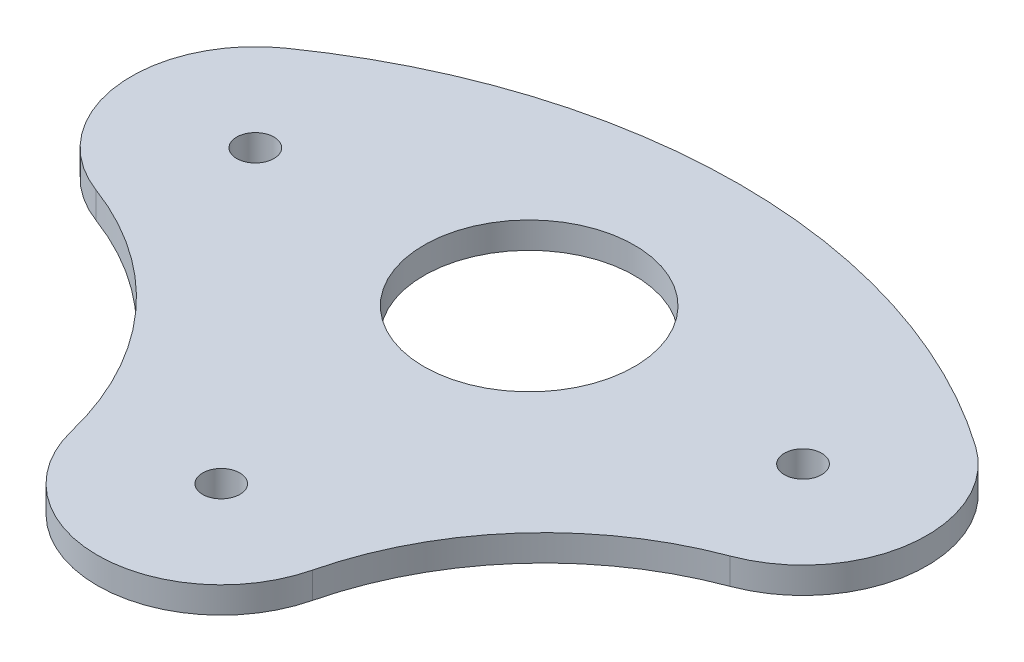
ISO-10303-21;
HEADER;
FILE_DESCRIPTION(('STEP AP214'),'2;1');
FILE_NAME('part.step','',(''),(''),'','','');
FILE_SCHEMA(('AUTOMOTIVE_DESIGN { 1 0 10303 214 1 1 1 1 }'));
ENDSEC;
DATA;
#1=APPLICATION_CONTEXT('core data for automotive mechanical design processes');
#2=APPLICATION_PROTOCOL_DEFINITION('international standard','automotive_design',2000,#1);
#3=PRODUCT_CONTEXT('',#1,'mechanical');
#4=PRODUCT('Part','Part','',(#3));
#5=PRODUCT_RELATED_PRODUCT_CATEGORY('part','',(#4));
#6=PRODUCT_DEFINITION_FORMATION('','',#4);
#7=PRODUCT_DEFINITION_CONTEXT('part definition',#1,'design');
#8=PRODUCT_DEFINITION('design','',#6,#7);
#9=PRODUCT_DEFINITION_SHAPE('','',#8);
#10=(LENGTH_UNIT() NAMED_UNIT(*) SI_UNIT(.MILLI.,.METRE.));
#11=(NAMED_UNIT(*) PLANE_ANGLE_UNIT() SI_UNIT($,.RADIAN.));
#12=(NAMED_UNIT(*) SI_UNIT($,.STERADIAN.) SOLID_ANGLE_UNIT());
#13=UNCERTAINTY_MEASURE_WITH_UNIT(LENGTH_MEASURE(1.E-05),#10,'distance_accuracy_value','');
#14=(GEOMETRIC_REPRESENTATION_CONTEXT(3) GLOBAL_UNCERTAINTY_ASSIGNED_CONTEXT((#13)) GLOBAL_UNIT_ASSIGNED_CONTEXT((#10,
#11,#12)) REPRESENTATION_CONTEXT('',''));
#15=CARTESIAN_POINT('',(0.,0.,0.));
#16=DIRECTION('',(0.,0.,1.));
#17=DIRECTION('',(1.,0.,0.));
#18=AXIS2_PLACEMENT_3D('',#15,#16,#17);
#19=CARTESIAN_POINT('',(16.5174,3.175,23.4951079196172));
#20=DIRECTION('',(0.,-1.,0.));
#21=DIRECTION('',(0.,0.,-1.));
#22=AXIS2_PLACEMENT_3D('',#19,#20,#21);
#23=PLANE('',#22);
#24=CARTESIAN_POINT('',(0.,3.175,46.9902158392344));
#25=DIRECTION('',(0.,1.,0.));
#26=DIRECTION('',(0.,0.,-1.));
#27=AXIS2_PLACEMENT_3D('',#24,#25,#26);
#28=CIRCLE('',#27,72.3902158392344);
#29=CARTESIAN_POINT('',(41.6327875385959,3.175,-12.2301721282306));
#30=VERTEX_POINT('',#29);
#31=CARTESIAN_POINT('',(-41.6327875385959,3.175,-12.2301721282306));
#32=VERTEX_POINT('',#31);
#33=EDGE_CURVE('E129',#30,#32,#28,.T.);
#34=ORIENTED_EDGE('',*,*,#33,.T.);
#35=CARTESIAN_POINT('',(-33.0348,3.175,0.));
#36=DIRECTION('',(0.,1.,0.));
#37=DIRECTION('',(0.,0.,1.));
#38=AXIS2_PLACEMENT_3D('',#35,#36,#37);
#39=CIRCLE('',#38,14.95);
#40=CARTESIAN_POINT('',(-38.2495467618594,3.175,14.0110283780198));
#41=VERTEX_POINT('',#40);
#42=EDGE_CURVE('E87',#32,#41,#39,.T.);
#43=ORIENTED_EDGE('',*,*,#42,.T.);
#44=CARTESIAN_POINT('',(-51.5393027235213,3.175,49.7180639099633));
#45=DIRECTION('',(0.,-1.,0.));
#46=DIRECTION('',(0.,0.,-1.));
#47=AXIS2_PLACEMENT_3D('',#44,#45,#46);
#48=CIRCLE('',#47,38.1);
#49=CARTESIAN_POINT('',(-14.5242709842911,3.175,40.690471465475));
#50=VERTEX_POINT('',#49);
#51=EDGE_CURVE('E100',#41,#50,#48,.T.);
#52=ORIENTED_EDGE('',*,*,#51,.T.);
#53=CARTESIAN_POINT('',(0.,3.175,37.1481484459185));
#54=DIRECTION('',(0.,1.,0.));
#55=DIRECTION('',(0.,0.,1.));
#56=AXIS2_PLACEMENT_3D('',#53,#54,#55);
#57=CIRCLE('',#56,14.95);
#58=CARTESIAN_POINT('',(14.5242709842911,3.175,40.690471465475));
#59=VERTEX_POINT('',#58);
#60=EDGE_CURVE('E94',#50,#59,#57,.T.);
#61=ORIENTED_EDGE('',*,*,#60,.T.);
#62=CARTESIAN_POINT('',(51.5393027235213,3.175,49.7180639099633));
#63=DIRECTION('',(0.,-1.,0.));
#64=DIRECTION('',(0.,0.,-1.));
#65=AXIS2_PLACEMENT_3D('',#62,#63,#64);
#66=CIRCLE('',#65,38.1);
#67=CARTESIAN_POINT('',(38.2495467618594,3.175,14.0110283780198));
#68=VERTEX_POINT('',#67);
#69=EDGE_CURVE('E98',#59,#68,#66,.T.);
#70=ORIENTED_EDGE('',*,*,#69,.T.);
#71=CARTESIAN_POINT('',(33.0348,3.175,0.));
#72=DIRECTION('',(0.,1.,0.));
#73=DIRECTION('',(0.,0.,1.));
#74=AXIS2_PLACEMENT_3D('',#71,#72,#73);
#75=CIRCLE('',#74,14.95);
#76=EDGE_CURVE('E50',#68,#30,#75,.T.);
#77=ORIENTED_EDGE('',*,*,#76,.T.);
#78=EDGE_LOOP('',(#34,#43,#52,#61,#70,#77));
#79=FACE_BOUND('',#78,.T.);
#80=CARTESIAN_POINT('',(0.,3.175,0.));
#81=DIRECTION('',(0.,1.,0.));
#82=DIRECTION('',(0.,0.,1.));
#83=AXIS2_PLACEMENT_3D('',#80,#81,#82);
#84=CIRCLE('',#83,12.7);
#85=CARTESIAN_POINT('',(0.,3.175,12.7));
#86=VERTEX_POINT('',#85);
#87=EDGE_CURVE('E122',#86,#86,#84,.T.);
#88=ORIENTED_EDGE('',*,*,#87,.F.);
#89=EDGE_LOOP('',(#88));
#90=FACE_BOUND('',#89,.T.);
#91=CARTESIAN_POINT('',(-33.0348,3.175,0.));
#92=DIRECTION('',(0.,1.,0.));
#93=DIRECTION('',(0.,0.,1.));
#94=AXIS2_PLACEMENT_3D('',#91,#92,#93);
#95=CIRCLE('',#94,2.25000000000001);
#96=CARTESIAN_POINT('',(-33.0348,3.175,2.25000000000002));
#97=VERTEX_POINT('',#96);
#98=EDGE_CURVE('E193',#97,#97,#95,.T.);
#99=ORIENTED_EDGE('',*,*,#98,.F.);
#100=EDGE_LOOP('',(#99));
#101=FACE_BOUND('',#100,.T.);
#102=CARTESIAN_POINT('',(33.0348,3.175,0.));
#103=DIRECTION('',(0.,1.,0.));
#104=DIRECTION('',(0.,0.,1.));
#105=AXIS2_PLACEMENT_3D('',#102,#103,#104);
#106=CIRCLE('',#105,2.25000000000001);
#107=CARTESIAN_POINT('',(33.0348,3.175,2.25000000000001));
#108=VERTEX_POINT('',#107);
#109=EDGE_CURVE('E187',#108,#108,#106,.T.);
#110=ORIENTED_EDGE('',*,*,#109,.F.);
#111=EDGE_LOOP('',(#110));
#112=FACE_BOUND('',#111,.T.);
#113=CARTESIAN_POINT('',(0.,3.175,37.1481484459185));
#114=DIRECTION('',(0.,1.,0.));
#115=DIRECTION('',(0.,0.,1.));
#116=AXIS2_PLACEMENT_3D('',#113,#114,#115);
#117=CIRCLE('',#116,2.24999999999998);
#118=CARTESIAN_POINT('',(0.,3.175,39.3981484459185));
#119=VERTEX_POINT('',#118);
#120=EDGE_CURVE('E178',#119,#119,#117,.T.);
#121=ORIENTED_EDGE('',*,*,#120,.F.);
#122=EDGE_LOOP('',(#121));
#123=FACE_BOUND('',#122,.T.);
#124=ADVANCED_FACE('F33',(#79,#90,#101,#112,#123),#23,.F.);
#125=CARTESIAN_POINT('',(16.5174,0.,23.4951079196172));
#126=DIRECTION('',(0.,-1.,0.));
#127=DIRECTION('',(0.,0.,-1.));
#128=AXIS2_PLACEMENT_3D('',#125,#126,#127);
#129=PLANE('',#128);
#130=CARTESIAN_POINT('',(33.0348,0.,0.));
#131=DIRECTION('',(0.,1.,0.));
#132=DIRECTION('',(0.,0.,1.));
#133=AXIS2_PLACEMENT_3D('',#130,#131,#132);
#134=CIRCLE('',#133,2.25000000000001);
#135=CARTESIAN_POINT('',(33.0348,0.,2.25000000000001));
#136=VERTEX_POINT('',#135);
#137=EDGE_CURVE('E184',#136,#136,#134,.T.);
#138=ORIENTED_EDGE('',*,*,#137,.T.);
#139=EDGE_LOOP('',(#138));
#140=FACE_BOUND('',#139,.T.);
#141=CARTESIAN_POINT('',(0.,0.,0.));
#142=DIRECTION('',(0.,1.,0.));
#143=DIRECTION('',(0.,0.,1.));
#144=AXIS2_PLACEMENT_3D('',#141,#142,#143);
#145=CIRCLE('',#144,12.7);
#146=CARTESIAN_POINT('',(0.,0.,12.7));
#147=VERTEX_POINT('',#146);
#148=EDGE_CURVE('E196',#147,#147,#145,.T.);
#149=ORIENTED_EDGE('',*,*,#148,.T.);
#150=EDGE_LOOP('',(#149));
#151=FACE_BOUND('',#150,.T.);
#152=CARTESIAN_POINT('',(0.,0.,46.9902158392344));
#153=DIRECTION('',(0.,1.,0.));
#154=DIRECTION('',(0.,0.,-1.));
#155=AXIS2_PLACEMENT_3D('',#152,#153,#154);
#156=CIRCLE('',#155,72.3902158392344);
#157=CARTESIAN_POINT('',(41.6327875385959,0.,-12.2301721282306));
#158=VERTEX_POINT('',#157);
#159=CARTESIAN_POINT('',(-41.6327875385959,0.,-12.2301721282306));
#160=VERTEX_POINT('',#159);
#161=EDGE_CURVE('E118',#158,#160,#156,.T.);
#162=ORIENTED_EDGE('',*,*,#161,.F.);
#163=CARTESIAN_POINT('',(33.0348,0.,0.));
#164=DIRECTION('',(0.,1.,0.));
#165=DIRECTION('',(0.,0.,1.));
#166=AXIS2_PLACEMENT_3D('',#163,#164,#165);
#167=CIRCLE('',#166,14.95);
#168=CARTESIAN_POINT('',(38.2495467618594,0.,14.0110283780198));
#169=VERTEX_POINT('',#168);
#170=EDGE_CURVE('E79',#169,#158,#167,.T.);
#171=ORIENTED_EDGE('',*,*,#170,.F.);
#172=CARTESIAN_POINT('',(51.5393027235213,0.,49.7180639099633));
#173=DIRECTION('',(0.,-1.,0.));
#174=DIRECTION('',(0.,0.,-1.));
#175=AXIS2_PLACEMENT_3D('',#172,#173,#174);
#176=CIRCLE('',#175,38.1);
#177=CARTESIAN_POINT('',(14.5242709842911,0.,40.690471465475));
#178=VERTEX_POINT('',#177);
#179=EDGE_CURVE('E73',#178,#169,#176,.T.);
#180=ORIENTED_EDGE('',*,*,#179,.F.);
#181=CARTESIAN_POINT('',(0.,0.,37.1481484459185));
#182=DIRECTION('',(0.,1.,0.));
#183=DIRECTION('',(0.,0.,1.));
#184=AXIS2_PLACEMENT_3D('',#181,#182,#183);
#185=CIRCLE('',#184,14.95);
#186=CARTESIAN_POINT('',(-14.5242709842911,0.,40.690471465475));
#187=VERTEX_POINT('',#186);
#188=EDGE_CURVE('E108',#187,#178,#185,.T.);
#189=ORIENTED_EDGE('',*,*,#188,.F.);
#190=CARTESIAN_POINT('',(-51.5393027235213,0.,49.7180639099633));
#191=DIRECTION('',(0.,-1.,0.));
#192=DIRECTION('',(0.,0.,-1.));
#193=AXIS2_PLACEMENT_3D('',#190,#191,#192);
#194=CIRCLE('',#193,38.1);
#195=CARTESIAN_POINT('',(-38.2495467618594,0.,14.0110283780198));
#196=VERTEX_POINT('',#195);
#197=EDGE_CURVE('E124',#196,#187,#194,.T.);
#198=ORIENTED_EDGE('',*,*,#197,.F.);
#199=CARTESIAN_POINT('',(-33.0348,0.,0.));
#200=DIRECTION('',(0.,1.,0.));
#201=DIRECTION('',(0.,0.,1.));
#202=AXIS2_PLACEMENT_3D('',#199,#200,#201);
#203=CIRCLE('',#202,14.95);
#204=EDGE_CURVE('E121',#160,#196,#203,.T.);
#205=ORIENTED_EDGE('',*,*,#204,.F.);
#206=EDGE_LOOP('',(#162,#171,#180,#189,#198,#205));
#207=FACE_BOUND('',#206,.T.);
#208=CARTESIAN_POINT('',(-33.0348,0.,0.));
#209=DIRECTION('',(0.,1.,0.));
#210=DIRECTION('',(0.,0.,1.));
#211=AXIS2_PLACEMENT_3D('',#208,#209,#210);
#212=CIRCLE('',#211,2.25000000000001);
#213=CARTESIAN_POINT('',(-33.0348,0.,2.25000000000002));
#214=VERTEX_POINT('',#213);
#215=EDGE_CURVE('E190',#214,#214,#212,.T.);
#216=ORIENTED_EDGE('',*,*,#215,.T.);
#217=EDGE_LOOP('',(#216));
#218=FACE_BOUND('',#217,.T.);
#219=CARTESIAN_POINT('',(0.,0.,37.1481484459185));
#220=DIRECTION('',(0.,1.,0.));
#221=DIRECTION('',(0.,0.,1.));
#222=AXIS2_PLACEMENT_3D('',#219,#220,#221);
#223=CIRCLE('',#222,2.24999999999998);
#224=CARTESIAN_POINT('',(0.,0.,39.3981484459185));
#225=VERTEX_POINT('',#224);
#226=EDGE_CURVE('E181',#225,#225,#223,.T.);
#227=ORIENTED_EDGE('',*,*,#226,.T.);
#228=EDGE_LOOP('',(#227));
#229=FACE_BOUND('',#228,.T.);
#230=ADVANCED_FACE('F138',(#140,#151,#207,#218,#229),#129,.T.);
#231=CARTESIAN_POINT('',(0.,3.175,46.9902158392344));
#232=DIRECTION('',(0.,-1.,0.));
#233=DIRECTION('',(0.,0.,-1.));
#234=AXIS2_PLACEMENT_3D('',#231,#232,#233);
#235=CYLINDRICAL_SURFACE('',#234,72.3902158392344);
#236=ORIENTED_EDGE('',*,*,#161,.T.);
#237=DIRECTION('',(0.,-1.,0.));
#238=VECTOR('',#237,1.);
#239=CARTESIAN_POINT('',(-41.6327875385959,3.175,-12.2301721282306));
#240=LINE('',#239,#238);
#241=EDGE_CURVE('E11',#32,#160,#240,.T.);
#242=ORIENTED_EDGE('',*,*,#241,.F.);
#243=ORIENTED_EDGE('',*,*,#33,.F.);
#244=DIRECTION('',(0.,-1.,0.));
#245=VECTOR('',#244,1.);
#246=CARTESIAN_POINT('',(41.6327875385959,3.175,-12.2301721282306));
#247=LINE('',#246,#245);
#248=EDGE_CURVE('E114',#30,#158,#247,.T.);
#249=ORIENTED_EDGE('',*,*,#248,.T.);
#250=EDGE_LOOP('',(#236,#242,#243,#249));
#251=FACE_BOUND('',#250,.T.);
#252=ADVANCED_FACE('F35',(#251),#235,.T.);
#253=CARTESIAN_POINT('',(-33.0348,3.175,0.));
#254=DIRECTION('',(0.,-1.,0.));
#255=DIRECTION('',(0.,0.,-1.));
#256=AXIS2_PLACEMENT_3D('',#253,#254,#255);
#257=CYLINDRICAL_SURFACE('',#256,14.95);
#258=ORIENTED_EDGE('',*,*,#204,.T.);
#259=DIRECTION('',(0.,-1.,0.));
#260=VECTOR('',#259,1.);
#261=CARTESIAN_POINT('',(-38.2495467618594,3.175,14.0110283780198));
#262=LINE('',#261,#260);
#263=EDGE_CURVE('E42',#41,#196,#262,.T.);
#264=ORIENTED_EDGE('',*,*,#263,.F.);
#265=ORIENTED_EDGE('',*,*,#42,.F.);
#266=ORIENTED_EDGE('',*,*,#241,.T.);
#267=EDGE_LOOP('',(#258,#264,#265,#266));
#268=FACE_BOUND('',#267,.T.);
#269=ADVANCED_FACE('F256',(#268),#257,.T.);
#270=CARTESIAN_POINT('',(-51.5393027235213,3.175,49.7180639099633));
#271=DIRECTION('',(0.,-1.,0.));
#272=DIRECTION('',(0.,0.,-1.));
#273=AXIS2_PLACEMENT_3D('',#270,#271,#272);
#274=CYLINDRICAL_SURFACE('',#273,38.1);
#275=ORIENTED_EDGE('',*,*,#197,.T.);
#276=DIRECTION('',(0.,-1.,0.));
#277=VECTOR('',#276,1.);
#278=CARTESIAN_POINT('',(-14.5242709842911,3.175,40.690471465475));
#279=LINE('',#278,#277);
#280=EDGE_CURVE('E109',#50,#187,#279,.T.);
#281=ORIENTED_EDGE('',*,*,#280,.F.);
#282=ORIENTED_EDGE('',*,*,#51,.F.);
#283=ORIENTED_EDGE('',*,*,#263,.T.);
#284=EDGE_LOOP('',(#275,#281,#282,#283));
#285=FACE_BOUND('',#284,.T.);
#286=ADVANCED_FACE('F135',(#285),#274,.F.);
#287=CARTESIAN_POINT('',(0.,3.175,37.1481484459185));
#288=DIRECTION('',(0.,-1.,0.));
#289=DIRECTION('',(0.,0.,-1.));
#290=AXIS2_PLACEMENT_3D('',#287,#288,#289);
#291=CYLINDRICAL_SURFACE('',#290,14.95);
#292=ORIENTED_EDGE('',*,*,#188,.T.);
#293=DIRECTION('',(0.,-1.,0.));
#294=VECTOR('',#293,1.);
#295=CARTESIAN_POINT('',(14.5242709842911,3.175,40.690471465475));
#296=LINE('',#295,#294);
#297=EDGE_CURVE('E105',#59,#178,#296,.T.);
#298=ORIENTED_EDGE('',*,*,#297,.F.);
#299=ORIENTED_EDGE('',*,*,#60,.F.);
#300=ORIENTED_EDGE('',*,*,#280,.T.);
#301=EDGE_LOOP('',(#292,#298,#299,#300));
#302=FACE_BOUND('',#301,.T.);
#303=ADVANCED_FACE('F106',(#302),#291,.T.);
#304=CARTESIAN_POINT('',(51.5393027235213,3.175,49.7180639099633));
#305=DIRECTION('',(0.,-1.,0.));
#306=DIRECTION('',(0.,0.,-1.));
#307=AXIS2_PLACEMENT_3D('',#304,#305,#306);
#308=CYLINDRICAL_SURFACE('',#307,38.1);
#309=ORIENTED_EDGE('',*,*,#179,.T.);
#310=DIRECTION('',(0.,-1.,0.));
#311=VECTOR('',#310,1.);
#312=CARTESIAN_POINT('',(38.2495467618594,3.175,14.0110283780198));
#313=LINE('',#312,#311);
#314=EDGE_CURVE('E110',#68,#169,#313,.T.);
#315=ORIENTED_EDGE('',*,*,#314,.F.);
#316=ORIENTED_EDGE('',*,*,#69,.F.);
#317=ORIENTED_EDGE('',*,*,#297,.T.);
#318=EDGE_LOOP('',(#309,#315,#316,#317));
#319=FACE_BOUND('',#318,.T.);
#320=ADVANCED_FACE('F112',(#319),#308,.F.);
#321=CARTESIAN_POINT('',(33.0348,3.175,0.));
#322=DIRECTION('',(0.,-1.,0.));
#323=DIRECTION('',(0.,0.,-1.));
#324=AXIS2_PLACEMENT_3D('',#321,#322,#323);
#325=CYLINDRICAL_SURFACE('',#324,14.95);
#326=ORIENTED_EDGE('',*,*,#170,.T.);
#327=ORIENTED_EDGE('',*,*,#248,.F.);
#328=ORIENTED_EDGE('',*,*,#76,.F.);
#329=ORIENTED_EDGE('',*,*,#314,.T.);
#330=EDGE_LOOP('',(#326,#327,#328,#329));
#331=FACE_BOUND('',#330,.T.);
#332=ADVANCED_FACE('F143',(#331),#325,.T.);
#333=CARTESIAN_POINT('',(0.,3.175,0.));
#334=DIRECTION('',(0.,-1.,0.));
#335=DIRECTION('',(0.,0.,-1.));
#336=AXIS2_PLACEMENT_3D('',#333,#334,#335);
#337=CYLINDRICAL_SURFACE('',#336,12.7);
#338=ORIENTED_EDGE('',*,*,#87,.T.);
#339=EDGE_LOOP('',(#338));
#340=FACE_BOUND('',#339,.T.);
#341=ORIENTED_EDGE('',*,*,#148,.F.);
#342=EDGE_LOOP('',(#341));
#343=FACE_BOUND('',#342,.T.);
#344=ADVANCED_FACE('F145',(#340,#343),#337,.F.);
#345=CARTESIAN_POINT('',(-33.0348,3.175,0.));
#346=DIRECTION('',(0.,-1.,0.));
#347=DIRECTION('',(0.,0.,-1.));
#348=AXIS2_PLACEMENT_3D('',#345,#346,#347);
#349=CYLINDRICAL_SURFACE('',#348,2.25000000000001);
#350=ORIENTED_EDGE('',*,*,#98,.T.);
#351=EDGE_LOOP('',(#350));
#352=FACE_BOUND('',#351,.T.);
#353=ORIENTED_EDGE('',*,*,#215,.F.);
#354=EDGE_LOOP('',(#353));
#355=FACE_BOUND('',#354,.T.);
#356=ADVANCED_FACE('F151',(#352,#355),#349,.F.);
#357=CARTESIAN_POINT('',(33.0348,3.175,0.));
#358=DIRECTION('',(0.,-1.,0.));
#359=DIRECTION('',(0.,0.,-1.));
#360=AXIS2_PLACEMENT_3D('',#357,#358,#359);
#361=CYLINDRICAL_SURFACE('',#360,2.25000000000001);
#362=ORIENTED_EDGE('',*,*,#109,.T.);
#363=EDGE_LOOP('',(#362));
#364=FACE_BOUND('',#363,.T.);
#365=ORIENTED_EDGE('',*,*,#137,.F.);
#366=EDGE_LOOP('',(#365));
#367=FACE_BOUND('',#366,.T.);
#368=ADVANCED_FACE('F165',(#364,#367),#361,.F.);
#369=CARTESIAN_POINT('',(0.,3.175,37.1481484459185));
#370=DIRECTION('',(0.,-1.,0.));
#371=DIRECTION('',(0.,0.,-1.));
#372=AXIS2_PLACEMENT_3D('',#369,#370,#371);
#373=CYLINDRICAL_SURFACE('',#372,2.24999999999998);
#374=ORIENTED_EDGE('',*,*,#120,.T.);
#375=EDGE_LOOP('',(#374));
#376=FACE_BOUND('',#375,.T.);
#377=ORIENTED_EDGE('',*,*,#226,.F.);
#378=EDGE_LOOP('',(#377));
#379=FACE_BOUND('',#378,.T.);
#380=ADVANCED_FACE('F169',(#376,#379),#373,.F.);
#381=CLOSED_SHELL('',(#124,#230,#252,#269,#286,#303,#320,#332,#344,#356,#368,#380));
#382=MANIFOLD_SOLID_BREP('B2',#381);
#383=ADVANCED_BREP_SHAPE_REPRESENTATION('',(#18,#382),#14);
#384=SHAPE_DEFINITION_REPRESENTATION(#9,#383);
ENDSEC;
END-ISO-10303-21;
